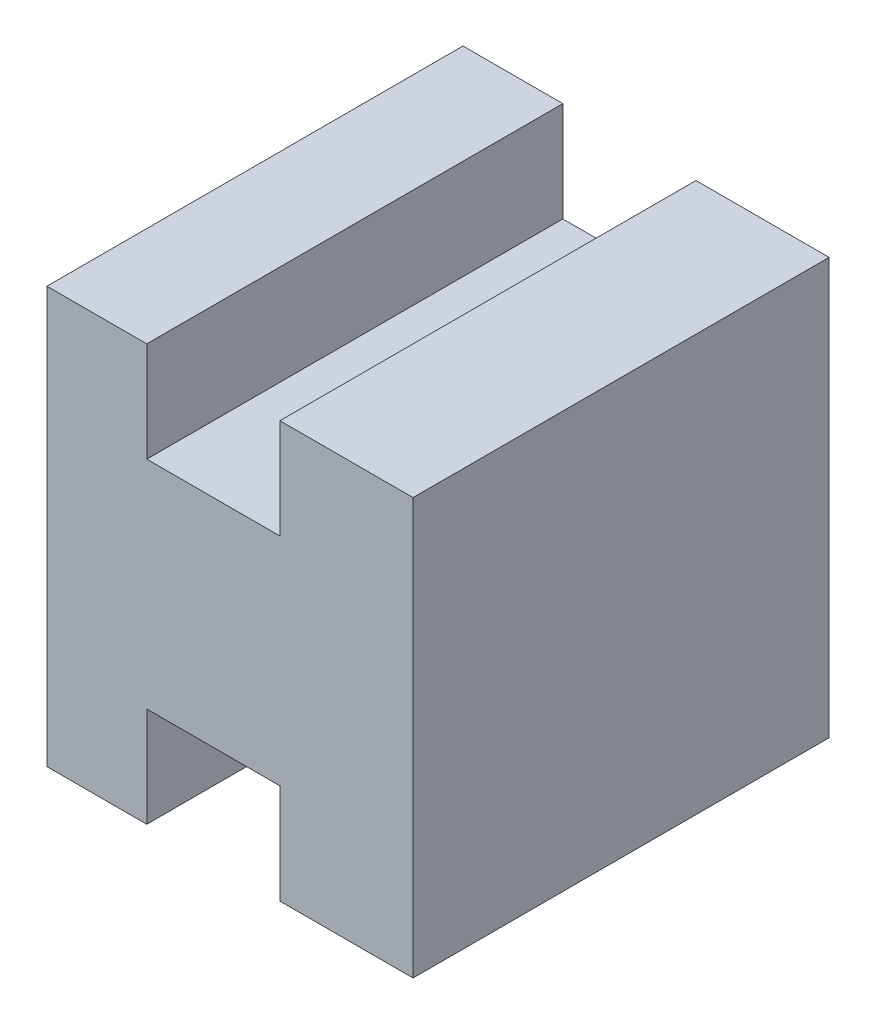
ISO-10303-21;
HEADER;
FILE_DESCRIPTION(('STEP AP214'),'2;1');
FILE_NAME('part.step','',(''),(''),'','','');
FILE_SCHEMA(('AUTOMOTIVE_DESIGN { 1 0 10303 214 1 1 1 1 }'));
ENDSEC;
DATA;
#1=APPLICATION_CONTEXT('core data for automotive mechanical design processes');
#2=APPLICATION_PROTOCOL_DEFINITION('international standard','automotive_design',2000,#1);
#3=PRODUCT_CONTEXT('',#1,'mechanical');
#4=PRODUCT('Part','Part','',(#3));
#5=PRODUCT_RELATED_PRODUCT_CATEGORY('part','',(#4));
#6=PRODUCT_DEFINITION_FORMATION('','',#4);
#7=PRODUCT_DEFINITION_CONTEXT('part definition',#1,'design');
#8=PRODUCT_DEFINITION('design','',#6,#7);
#9=PRODUCT_DEFINITION_SHAPE('','',#8);
#10=(LENGTH_UNIT() NAMED_UNIT(*) SI_UNIT(.MILLI.,.METRE.));
#11=(NAMED_UNIT(*) PLANE_ANGLE_UNIT() SI_UNIT($,.RADIAN.));
#12=(NAMED_UNIT(*) SI_UNIT($,.STERADIAN.) SOLID_ANGLE_UNIT());
#13=UNCERTAINTY_MEASURE_WITH_UNIT(LENGTH_MEASURE(1.E-05),#10,'distance_accuracy_value','');
#14=(GEOMETRIC_REPRESENTATION_CONTEXT(3) GLOBAL_UNCERTAINTY_ASSIGNED_CONTEXT((#13)) GLOBAL_UNIT_ASSIGNED_CONTEXT((#10,
#11,#12)) REPRESENTATION_CONTEXT('',''));
#15=CARTESIAN_POINT('',(0.,0.,0.));
#16=DIRECTION('',(0.,0.,1.));
#17=DIRECTION('',(1.,0.,0.));
#18=AXIS2_PLACEMENT_3D('',#15,#16,#17);
#19=CARTESIAN_POINT('',(-90.6145773733258,45.4594081977058,12.5));
#20=DIRECTION('',(1.,0.,0.));
#21=DIRECTION('',(0.,0.,-1.));
#22=AXIS2_PLACEMENT_3D('',#19,#20,#21);
#23=PLANE('',#22);
#24=DIRECTION('',(0.,-1.,0.));
#25=VECTOR('',#24,1.);
#26=CARTESIAN_POINT('',(-90.6145773733258,45.4594081977058,0.));
#27=LINE('',#26,#25);
#28=CARTESIAN_POINT('',(-90.6145773733258,45.4594081977058,0.));
#29=VERTEX_POINT('',#28);
#30=CARTESIAN_POINT('',(-90.6145773733258,32.9594081977058,0.));
#31=VERTEX_POINT('',#30);
#32=EDGE_CURVE('E153',#29,#31,#27,.T.);
#33=ORIENTED_EDGE('',*,*,#32,.T.);
#34=DIRECTION('',(0.,0.,-1.));
#35=VECTOR('',#34,1.);
#36=CARTESIAN_POINT('',(-90.6145773733258,32.9594081977058,12.5));
#37=LINE('',#36,#35);
#38=CARTESIAN_POINT('',(-90.6145773733258,32.9594081977058,12.5));
#39=VERTEX_POINT('',#38);
#40=EDGE_CURVE('E11',#39,#31,#37,.T.);
#41=ORIENTED_EDGE('',*,*,#40,.F.);
#42=DIRECTION('',(0.,-1.,0.));
#43=VECTOR('',#42,1.);
#44=CARTESIAN_POINT('',(-90.6145773733258,45.4594081977058,12.5));
#45=LINE('',#44,#43);
#46=CARTESIAN_POINT('',(-90.6145773733258,45.4594081977058,12.5));
#47=VERTEX_POINT('',#46);
#48=EDGE_CURVE('E175',#47,#39,#45,.T.);
#49=ORIENTED_EDGE('',*,*,#48,.F.);
#50=DIRECTION('',(0.,0.,-1.));
#51=VECTOR('',#50,1.);
#52=CARTESIAN_POINT('',(-90.6145773733258,45.4594081977058,12.5));
#53=LINE('',#52,#51);
#54=EDGE_CURVE('E149',#47,#29,#53,.T.);
#55=ORIENTED_EDGE('',*,*,#54,.T.);
#56=EDGE_LOOP('',(#33,#41,#49,#55));
#57=FACE_BOUND('',#56,.T.);
#58=ADVANCED_FACE('F33',(#57),#23,.F.);
#59=CARTESIAN_POINT('',(-90.6145773733258,32.9594081977058,12.5));
#60=DIRECTION('',(0.,1.,0.));
#61=DIRECTION('',(0.,0.,1.));
#62=AXIS2_PLACEMENT_3D('',#59,#60,#61);
#63=PLANE('',#62);
#64=DIRECTION('',(1.,0.,0.));
#65=VECTOR('',#64,1.);
#66=CARTESIAN_POINT('',(-90.6145773733258,32.9594081977058,0.));
#67=LINE('',#66,#65);
#68=CARTESIAN_POINT('',(-87.6145773733258,32.9594081977058,0.));
#69=VERTEX_POINT('',#68);
#70=EDGE_CURVE('E156',#31,#69,#67,.T.);
#71=ORIENTED_EDGE('',*,*,#70,.T.);
#72=DIRECTION('',(0.,0.,-1.));
#73=VECTOR('',#72,1.);
#74=CARTESIAN_POINT('',(-87.6145773733258,32.9594081977058,12.5));
#75=LINE('',#74,#73);
#76=CARTESIAN_POINT('',(-87.6145773733258,32.9594081977058,12.5));
#77=VERTEX_POINT('',#76);
#78=EDGE_CURVE('E41',#77,#69,#75,.T.);
#79=ORIENTED_EDGE('',*,*,#78,.F.);
#80=DIRECTION('',(1.,0.,0.));
#81=VECTOR('',#80,1.);
#82=CARTESIAN_POINT('',(-90.6145773733258,32.9594081977058,12.5));
#83=LINE('',#82,#81);
#84=EDGE_CURVE('E104',#39,#77,#83,.T.);
#85=ORIENTED_EDGE('',*,*,#84,.F.);
#86=ORIENTED_EDGE('',*,*,#40,.T.);
#87=EDGE_LOOP('',(#71,#79,#85,#86));
#88=FACE_BOUND('',#87,.T.);
#89=ADVANCED_FACE('F253',(#88),#63,.F.);
#90=CARTESIAN_POINT('',(-87.6145773733258,32.9594081977058,12.5));
#91=DIRECTION('',(-1.,0.,0.));
#92=DIRECTION('',(0.,0.,1.));
#93=AXIS2_PLACEMENT_3D('',#90,#91,#92);
#94=PLANE('',#93);
#95=DIRECTION('',(0.,1.,0.));
#96=VECTOR('',#95,1.);
#97=CARTESIAN_POINT('',(-87.6145773733258,32.9594081977058,0.));
#98=LINE('',#97,#96);
#99=CARTESIAN_POINT('',(-87.6145773733258,35.9594081977058,0.));
#100=VERTEX_POINT('',#99);
#101=EDGE_CURVE('E158',#69,#100,#98,.T.);
#102=ORIENTED_EDGE('',*,*,#101,.T.);
#103=DIRECTION('',(0.,0.,-1.));
#104=VECTOR('',#103,1.);
#105=CARTESIAN_POINT('',(-87.6145773733258,35.9594081977058,12.5));
#106=LINE('',#105,#104);
#107=CARTESIAN_POINT('',(-87.6145773733258,35.9594081977058,12.5));
#108=VERTEX_POINT('',#107);
#109=EDGE_CURVE('E194',#108,#100,#106,.T.);
#110=ORIENTED_EDGE('',*,*,#109,.F.);
#111=DIRECTION('',(0.,1.,0.));
#112=VECTOR('',#111,1.);
#113=CARTESIAN_POINT('',(-87.6145773733258,32.9594081977058,12.5));
#114=LINE('',#113,#112);
#115=EDGE_CURVE('E202',#77,#108,#114,.T.);
#116=ORIENTED_EDGE('',*,*,#115,.F.);
#117=ORIENTED_EDGE('',*,*,#78,.T.);
#118=EDGE_LOOP('',(#102,#110,#116,#117));
#119=FACE_BOUND('',#118,.T.);
#120=ADVANCED_FACE('F200',(#119),#94,.F.);
#121=CARTESIAN_POINT('',(-87.6145773733258,35.9594081977058,12.5));
#122=DIRECTION('',(0.,1.,0.));
#123=DIRECTION('',(0.,0.,1.));
#124=AXIS2_PLACEMENT_3D('',#121,#122,#123);
#125=PLANE('',#124);
#126=DIRECTION('',(1.,0.,0.));
#127=VECTOR('',#126,1.);
#128=CARTESIAN_POINT('',(-87.6145773733258,35.9594081977058,0.));
#129=LINE('',#128,#127);
#130=CARTESIAN_POINT('',(-83.6145773733258,35.9594081977058,0.));
#131=VERTEX_POINT('',#130);
#132=EDGE_CURVE('E160',#100,#131,#129,.T.);
#133=ORIENTED_EDGE('',*,*,#132,.T.);
#134=DIRECTION('',(0.,0.,-1.));
#135=VECTOR('',#134,1.);
#136=CARTESIAN_POINT('',(-83.6145773733258,35.9594081977058,12.5));
#137=LINE('',#136,#135);
#138=CARTESIAN_POINT('',(-83.6145773733258,35.9594081977058,12.5));
#139=VERTEX_POINT('',#138);
#140=EDGE_CURVE('E191',#139,#131,#137,.T.);
#141=ORIENTED_EDGE('',*,*,#140,.F.);
#142=DIRECTION('',(1.,0.,0.));
#143=VECTOR('',#142,1.);
#144=CARTESIAN_POINT('',(-87.6145773733258,35.9594081977058,12.5));
#145=LINE('',#144,#143);
#146=EDGE_CURVE('E220',#108,#139,#145,.T.);
#147=ORIENTED_EDGE('',*,*,#146,.F.);
#148=ORIENTED_EDGE('',*,*,#109,.T.);
#149=EDGE_LOOP('',(#133,#141,#147,#148));
#150=FACE_BOUND('',#149,.T.);
#151=ADVANCED_FACE('F211',(#150),#125,.F.);
#152=CARTESIAN_POINT('',(-83.6145773733258,35.9594081977058,12.5));
#153=DIRECTION('',(1.,0.,0.));
#154=DIRECTION('',(0.,0.,-1.));
#155=AXIS2_PLACEMENT_3D('',#152,#153,#154);
#156=PLANE('',#155);
#157=DIRECTION('',(0.,-1.,0.));
#158=VECTOR('',#157,1.);
#159=CARTESIAN_POINT('',(-83.6145773733258,35.9594081977058,0.));
#160=LINE('',#159,#158);
#161=CARTESIAN_POINT('',(-83.6145773733258,32.9594081977058,0.));
#162=VERTEX_POINT('',#161);
#163=EDGE_CURVE('E162',#131,#162,#160,.T.);
#164=ORIENTED_EDGE('',*,*,#163,.T.);
#165=DIRECTION('',(0.,0.,-1.));
#166=VECTOR('',#165,1.);
#167=CARTESIAN_POINT('',(-83.6145773733258,32.9594081977058,12.5));
#168=LINE('',#167,#166);
#169=CARTESIAN_POINT('',(-83.6145773733258,32.9594081977058,12.5));
#170=VERTEX_POINT('',#169);
#171=EDGE_CURVE('E188',#170,#162,#168,.T.);
#172=ORIENTED_EDGE('',*,*,#171,.F.);
#173=DIRECTION('',(0.,-1.,0.));
#174=VECTOR('',#173,1.);
#175=CARTESIAN_POINT('',(-83.6145773733258,35.9594081977058,12.5));
#176=LINE('',#175,#174);
#177=EDGE_CURVE('E217',#139,#170,#176,.T.);
#178=ORIENTED_EDGE('',*,*,#177,.F.);
#179=ORIENTED_EDGE('',*,*,#140,.T.);
#180=EDGE_LOOP('',(#164,#172,#178,#179));
#181=FACE_BOUND('',#180,.T.);
#182=ADVANCED_FACE('F215',(#181),#156,.F.);
#183=CARTESIAN_POINT('',(-83.6145773733258,32.9594081977058,12.5));
#184=DIRECTION('',(0.,1.,0.));
#185=DIRECTION('',(0.,0.,1.));
#186=AXIS2_PLACEMENT_3D('',#183,#184,#185);
#187=PLANE('',#186);
#188=DIRECTION('',(1.,0.,0.));
#189=VECTOR('',#188,1.);
#190=CARTESIAN_POINT('',(-83.6145773733258,32.9594081977058,0.));
#191=LINE('',#190,#189);
#192=CARTESIAN_POINT('',(-79.6145773733258,32.9594081977058,0.));
#193=VERTEX_POINT('',#192);
#194=EDGE_CURVE('E164',#162,#193,#191,.T.);
#195=ORIENTED_EDGE('',*,*,#194,.T.);
#196=DIRECTION('',(0.,0.,-1.));
#197=VECTOR('',#196,1.);
#198=CARTESIAN_POINT('',(-79.6145773733258,32.9594081977058,12.5));
#199=LINE('',#198,#197);
#200=CARTESIAN_POINT('',(-79.6145773733258,32.9594081977058,12.5));
#201=VERTEX_POINT('',#200);
#202=EDGE_CURVE('E185',#201,#193,#199,.T.);
#203=ORIENTED_EDGE('',*,*,#202,.F.);
#204=DIRECTION('',(1.,0.,0.));
#205=VECTOR('',#204,1.);
#206=CARTESIAN_POINT('',(-83.6145773733258,32.9594081977058,12.5));
#207=LINE('',#206,#205);
#208=EDGE_CURVE('E219',#170,#201,#207,.T.);
#209=ORIENTED_EDGE('',*,*,#208,.F.);
#210=ORIENTED_EDGE('',*,*,#171,.T.);
#211=EDGE_LOOP('',(#195,#203,#209,#210));
#212=FACE_BOUND('',#211,.T.);
#213=ADVANCED_FACE('F266',(#212),#187,.F.);
#214=CARTESIAN_POINT('',(-79.6145773733258,45.4594081977058,12.5));
#215=DIRECTION('',(-1.,0.,0.));
#216=DIRECTION('',(0.,-1.,0.));
#217=AXIS2_PLACEMENT_3D('',#214,#215,#216);
#218=PLANE('',#217);
#219=DIRECTION('',(0.,1.,0.));
#220=VECTOR('',#219,1.);
#221=CARTESIAN_POINT('',(-79.6145773733258,45.4594081977058,0.));
#222=LINE('',#221,#220);
#223=CARTESIAN_POINT('',(-79.6145773733258,45.4594081977058,0.));
#224=VERTEX_POINT('',#223);
#225=EDGE_CURVE('E166',#193,#224,#222,.T.);
#226=ORIENTED_EDGE('',*,*,#225,.T.);
#227=DIRECTION('',(0.,0.,-1.));
#228=VECTOR('',#227,1.);
#229=CARTESIAN_POINT('',(-79.6145773733258,45.4594081977058,12.5));
#230=LINE('',#229,#228);
#231=CARTESIAN_POINT('',(-79.6145773733258,45.4594081977058,12.5));
#232=VERTEX_POINT('',#231);
#233=EDGE_CURVE('E182',#232,#224,#230,.T.);
#234=ORIENTED_EDGE('',*,*,#233,.F.);
#235=DIRECTION('',(0.,1.,0.));
#236=VECTOR('',#235,1.);
#237=CARTESIAN_POINT('',(-79.6145773733258,45.4594081977058,12.5));
#238=LINE('',#237,#236);
#239=EDGE_CURVE('E222',#201,#232,#238,.T.);
#240=ORIENTED_EDGE('',*,*,#239,.F.);
#241=ORIENTED_EDGE('',*,*,#202,.T.);
#242=EDGE_LOOP('',(#226,#234,#240,#241));
#243=FACE_BOUND('',#242,.T.);
#244=ADVANCED_FACE('F269',(#243),#218,.F.);
#245=CARTESIAN_POINT('',(-83.6145773733258,45.4594081977058,12.5));
#246=DIRECTION('',(0.,-1.,0.));
#247=DIRECTION('',(0.,0.,-1.));
#248=AXIS2_PLACEMENT_3D('',#245,#246,#247);
#249=PLANE('',#248);
#250=DIRECTION('',(-1.,0.,0.));
#251=VECTOR('',#250,1.);
#252=CARTESIAN_POINT('',(-83.6145773733258,45.4594081977058,0.));
#253=LINE('',#252,#251);
#254=CARTESIAN_POINT('',(-83.6145773733258,45.4594081977058,0.));
#255=VERTEX_POINT('',#254);
#256=EDGE_CURVE('E168',#224,#255,#253,.T.);
#257=ORIENTED_EDGE('',*,*,#256,.T.);
#258=DIRECTION('',(0.,0.,-1.));
#259=VECTOR('',#258,1.);
#260=CARTESIAN_POINT('',(-83.6145773733258,45.4594081977058,12.5));
#261=LINE('',#260,#259);
#262=CARTESIAN_POINT('',(-83.6145773733258,45.4594081977058,12.5));
#263=VERTEX_POINT('',#262);
#264=EDGE_CURVE('E179',#263,#255,#261,.T.);
#265=ORIENTED_EDGE('',*,*,#264,.F.);
#266=DIRECTION('',(-1.,0.,0.));
#267=VECTOR('',#266,1.);
#268=CARTESIAN_POINT('',(-83.6145773733258,45.4594081977058,12.5));
#269=LINE('',#268,#267);
#270=EDGE_CURVE('E228',#232,#263,#269,.T.);
#271=ORIENTED_EDGE('',*,*,#270,.F.);
#272=ORIENTED_EDGE('',*,*,#233,.T.);
#273=EDGE_LOOP('',(#257,#265,#271,#272));
#274=FACE_BOUND('',#273,.T.);
#275=ADVANCED_FACE('F234',(#274),#249,.F.);
#276=CARTESIAN_POINT('',(-83.6145773733258,42.4594081977058,12.5));
#277=DIRECTION('',(1.,0.,0.));
#278=DIRECTION('',(0.,0.,-1.));
#279=AXIS2_PLACEMENT_3D('',#276,#277,#278);
#280=PLANE('',#279);
#281=DIRECTION('',(0.,-1.,0.));
#282=VECTOR('',#281,1.);
#283=CARTESIAN_POINT('',(-83.6145773733258,42.4594081977058,0.));
#284=LINE('',#283,#282);
#285=CARTESIAN_POINT('',(-83.6145773733258,42.4594081977058,0.));
#286=VERTEX_POINT('',#285);
#287=EDGE_CURVE('E170',#255,#286,#284,.T.);
#288=ORIENTED_EDGE('',*,*,#287,.T.);
#289=DIRECTION('',(0.,0.,-1.));
#290=VECTOR('',#289,1.);
#291=CARTESIAN_POINT('',(-83.6145773733258,42.4594081977058,12.5));
#292=LINE('',#291,#290);
#293=CARTESIAN_POINT('',(-83.6145773733258,42.4594081977058,12.5));
#294=VERTEX_POINT('',#293);
#295=EDGE_CURVE('E144',#294,#286,#292,.T.);
#296=ORIENTED_EDGE('',*,*,#295,.F.);
#297=DIRECTION('',(0.,-1.,0.));
#298=VECTOR('',#297,1.);
#299=CARTESIAN_POINT('',(-83.6145773733258,42.4594081977058,12.5));
#300=LINE('',#299,#298);
#301=EDGE_CURVE('E135',#263,#294,#300,.T.);
#302=ORIENTED_EDGE('',*,*,#301,.F.);
#303=ORIENTED_EDGE('',*,*,#264,.T.);
#304=EDGE_LOOP('',(#288,#296,#302,#303));
#305=FACE_BOUND('',#304,.T.);
#306=ADVANCED_FACE('F238',(#305),#280,.F.);
#307=CARTESIAN_POINT('',(-87.6145773733258,42.4594081977058,12.5));
#308=DIRECTION('',(0.,-1.,0.));
#309=DIRECTION('',(0.,0.,-1.));
#310=AXIS2_PLACEMENT_3D('',#307,#308,#309);
#311=PLANE('',#310);
#312=DIRECTION('',(-1.,0.,0.));
#313=VECTOR('',#312,1.);
#314=CARTESIAN_POINT('',(-87.6145773733258,42.4594081977058,0.));
#315=LINE('',#314,#313);
#316=CARTESIAN_POINT('',(-87.6145773733258,42.4594081977058,0.));
#317=VERTEX_POINT('',#316);
#318=EDGE_CURVE('E143',#286,#317,#315,.T.);
#319=ORIENTED_EDGE('',*,*,#318,.T.);
#320=DIRECTION('',(0.,0.,-1.));
#321=VECTOR('',#320,1.);
#322=CARTESIAN_POINT('',(-87.6145773733258,42.4594081977058,12.5));
#323=LINE('',#322,#321);
#324=CARTESIAN_POINT('',(-87.6145773733258,42.4594081977058,12.5));
#325=VERTEX_POINT('',#324);
#326=EDGE_CURVE('E140',#325,#317,#323,.T.);
#327=ORIENTED_EDGE('',*,*,#326,.F.);
#328=DIRECTION('',(-1.,0.,0.));
#329=VECTOR('',#328,1.);
#330=CARTESIAN_POINT('',(-87.6145773733258,42.4594081977058,12.5));
#331=LINE('',#330,#329);
#332=EDGE_CURVE('E129',#294,#325,#331,.T.);
#333=ORIENTED_EDGE('',*,*,#332,.F.);
#334=ORIENTED_EDGE('',*,*,#295,.T.);
#335=EDGE_LOOP('',(#319,#327,#333,#334));
#336=FACE_BOUND('',#335,.T.);
#337=ADVANCED_FACE('F141',(#336),#311,.F.);
#338=CARTESIAN_POINT('',(-87.6145773733258,45.4594081977058,12.5));
#339=DIRECTION('',(-1.,0.,0.));
#340=DIRECTION('',(0.,0.,1.));
#341=AXIS2_PLACEMENT_3D('',#338,#339,#340);
#342=PLANE('',#341);
#343=DIRECTION('',(0.,1.,0.));
#344=VECTOR('',#343,1.);
#345=CARTESIAN_POINT('',(-87.6145773733258,45.4594081977058,0.));
#346=LINE('',#345,#344);
#347=CARTESIAN_POINT('',(-87.6145773733258,45.4594081977058,0.));
#348=VERTEX_POINT('',#347);
#349=EDGE_CURVE('E90',#317,#348,#346,.T.);
#350=ORIENTED_EDGE('',*,*,#349,.T.);
#351=DIRECTION('',(0.,0.,-1.));
#352=VECTOR('',#351,1.);
#353=CARTESIAN_POINT('',(-87.6145773733258,45.4594081977058,12.5));
#354=LINE('',#353,#352);
#355=CARTESIAN_POINT('',(-87.6145773733258,45.4594081977058,12.5));
#356=VERTEX_POINT('',#355);
#357=EDGE_CURVE('E145',#356,#348,#354,.T.);
#358=ORIENTED_EDGE('',*,*,#357,.F.);
#359=DIRECTION('',(0.,1.,0.));
#360=VECTOR('',#359,1.);
#361=CARTESIAN_POINT('',(-87.6145773733258,45.4594081977058,12.5));
#362=LINE('',#361,#360);
#363=EDGE_CURVE('E133',#325,#356,#362,.T.);
#364=ORIENTED_EDGE('',*,*,#363,.F.);
#365=ORIENTED_EDGE('',*,*,#326,.T.);
#366=EDGE_LOOP('',(#350,#358,#364,#365));
#367=FACE_BOUND('',#366,.T.);
#368=ADVANCED_FACE('F147',(#367),#342,.F.);
#369=CARTESIAN_POINT('',(-90.6145773733258,45.4594081977058,12.5));
#370=DIRECTION('',(0.,-1.,0.));
#371=DIRECTION('',(0.,0.,-1.));
#372=AXIS2_PLACEMENT_3D('',#369,#370,#371);
#373=PLANE('',#372);
#374=DIRECTION('',(-1.,0.,0.));
#375=VECTOR('',#374,1.);
#376=CARTESIAN_POINT('',(-90.6145773733258,45.4594081977058,0.));
#377=LINE('',#376,#375);
#378=EDGE_CURVE('E96',#348,#29,#377,.T.);
#379=ORIENTED_EDGE('',*,*,#378,.T.);
#380=ORIENTED_EDGE('',*,*,#54,.F.);
#381=DIRECTION('',(-1.,0.,0.));
#382=VECTOR('',#381,1.);
#383=CARTESIAN_POINT('',(-90.6145773733258,45.4594081977058,12.5));
#384=LINE('',#383,#382);
#385=EDGE_CURVE('E49',#356,#47,#384,.T.);
#386=ORIENTED_EDGE('',*,*,#385,.F.);
#387=ORIENTED_EDGE('',*,*,#357,.T.);
#388=EDGE_LOOP('',(#379,#380,#386,#387));
#389=FACE_BOUND('',#388,.T.);
#390=ADVANCED_FACE('F242',(#389),#373,.F.);
#391=CARTESIAN_POINT('',(0.,0.,12.5));
#392=DIRECTION('',(0.,0.,1.));
#393=DIRECTION('',(1.,0.,0.));
#394=AXIS2_PLACEMENT_3D('',#391,#392,#393);
#395=PLANE('',#394);
#396=ORIENTED_EDGE('',*,*,#48,.T.);
#397=ORIENTED_EDGE('',*,*,#84,.T.);
#398=ORIENTED_EDGE('',*,*,#115,.T.);
#399=ORIENTED_EDGE('',*,*,#146,.T.);
#400=ORIENTED_EDGE('',*,*,#177,.T.);
#401=ORIENTED_EDGE('',*,*,#208,.T.);
#402=ORIENTED_EDGE('',*,*,#239,.T.);
#403=ORIENTED_EDGE('',*,*,#270,.T.);
#404=ORIENTED_EDGE('',*,*,#301,.T.);
#405=ORIENTED_EDGE('',*,*,#332,.T.);
#406=ORIENTED_EDGE('',*,*,#363,.T.);
#407=ORIENTED_EDGE('',*,*,#385,.T.);
#408=EDGE_LOOP('',(#396,#397,#398,#399,#400,#401,#402,#403,#404,#405,#406,#407));
#409=FACE_BOUND('',#408,.T.);
#410=ADVANCED_FACE('F131',(#409),#395,.T.);
#411=CARTESIAN_POINT('',(0.,0.,0.));
#412=DIRECTION('',(0.,0.,1.));
#413=DIRECTION('',(1.,0.,0.));
#414=AXIS2_PLACEMENT_3D('',#411,#412,#413);
#415=PLANE('',#414);
#416=ORIENTED_EDGE('',*,*,#32,.F.);
#417=ORIENTED_EDGE('',*,*,#378,.F.);
#418=ORIENTED_EDGE('',*,*,#349,.F.);
#419=ORIENTED_EDGE('',*,*,#318,.F.);
#420=ORIENTED_EDGE('',*,*,#287,.F.);
#421=ORIENTED_EDGE('',*,*,#256,.F.);
#422=ORIENTED_EDGE('',*,*,#225,.F.);
#423=ORIENTED_EDGE('',*,*,#194,.F.);
#424=ORIENTED_EDGE('',*,*,#163,.F.);
#425=ORIENTED_EDGE('',*,*,#132,.F.);
#426=ORIENTED_EDGE('',*,*,#101,.F.);
#427=ORIENTED_EDGE('',*,*,#70,.F.);
#428=EDGE_LOOP('',(#416,#417,#418,#419,#420,#421,#422,#423,#424,#425,#426,#427));
#429=FACE_BOUND('',#428,.T.);
#430=ADVANCED_FACE('F206',(#429),#415,.F.);
#431=CLOSED_SHELL('',(#58,#89,#120,#151,#182,#213,#244,#275,#306,#337,#368,#390,#410,#430));
#432=MANIFOLD_SOLID_BREP('B2',#431);
#433=ADVANCED_BREP_SHAPE_REPRESENTATION('',(#18,#432),#14);
#434=SHAPE_DEFINITION_REPRESENTATION(#9,#433);
ENDSEC;
END-ISO-10303-21;
